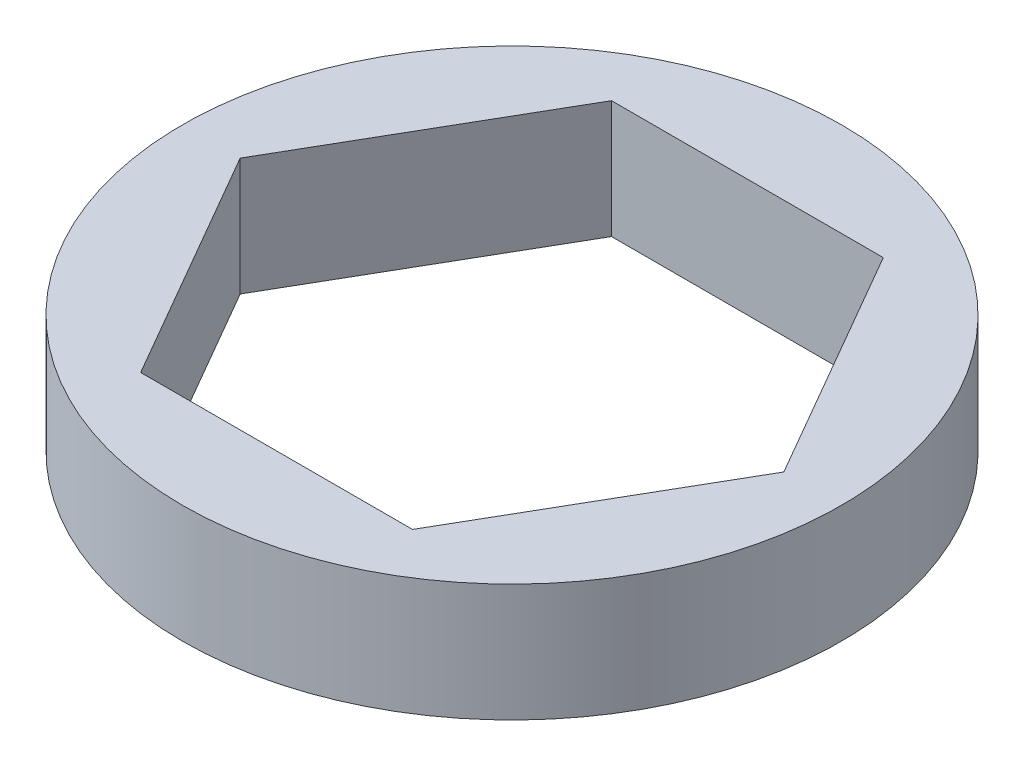
ISO-10303-21;
HEADER;
FILE_DESCRIPTION(('STEP AP214'),'2;1');
FILE_NAME('part.step','',(''),(''),'','','');
FILE_SCHEMA(('AUTOMOTIVE_DESIGN { 1 0 10303 214 1 1 1 1 }'));
ENDSEC;
DATA;
#1=APPLICATION_CONTEXT('core data for automotive mechanical design processes');
#2=APPLICATION_PROTOCOL_DEFINITION('international standard','automotive_design',2000,#1);
#3=PRODUCT_CONTEXT('',#1,'mechanical');
#4=PRODUCT('Part','Part','',(#3));
#5=PRODUCT_RELATED_PRODUCT_CATEGORY('part','',(#4));
#6=PRODUCT_DEFINITION_FORMATION('','',#4);
#7=PRODUCT_DEFINITION_CONTEXT('part definition',#1,'design');
#8=PRODUCT_DEFINITION('design','',#6,#7);
#9=PRODUCT_DEFINITION_SHAPE('','',#8);
#10=(LENGTH_UNIT() NAMED_UNIT(*) SI_UNIT(.MILLI.,.METRE.));
#11=(NAMED_UNIT(*) PLANE_ANGLE_UNIT() SI_UNIT($,.RADIAN.));
#12=(NAMED_UNIT(*) SI_UNIT($,.STERADIAN.) SOLID_ANGLE_UNIT());
#13=UNCERTAINTY_MEASURE_WITH_UNIT(LENGTH_MEASURE(1.E-05),#10,'distance_accuracy_value','');
#14=(GEOMETRIC_REPRESENTATION_CONTEXT(3) GLOBAL_UNCERTAINTY_ASSIGNED_CONTEXT((#13)) GLOBAL_UNIT_ASSIGNED_CONTEXT((#10,
#11,#12)) REPRESENTATION_CONTEXT('',''));
#15=CARTESIAN_POINT('',(0.,0.,0.));
#16=DIRECTION('',(0.,0.,1.));
#17=DIRECTION('',(1.,0.,0.));
#18=AXIS2_PLACEMENT_3D('',#15,#16,#17);
#19=CARTESIAN_POINT('',(0.,3.175,0.));
#20=DIRECTION('',(0.,1.,0.));
#21=DIRECTION('',(0.,0.,1.));
#22=AXIS2_PLACEMENT_3D('',#19,#20,#21);
#23=PLANE('',#22);
#24=CARTESIAN_POINT('',(0.,3.175,0.));
#25=DIRECTION('',(0.,1.,0.));
#26=DIRECTION('',(0.,0.,1.));
#27=AXIS2_PLACEMENT_3D('',#24,#25,#26);
#28=CIRCLE('',#27,8.89);
#29=CARTESIAN_POINT('',(0.,3.175,8.89));
#30=VERTEX_POINT('',#29);
#31=EDGE_CURVE('E11',#30,#30,#28,.T.);
#32=ORIENTED_EDGE('',*,*,#31,.T.);
#33=EDGE_LOOP('',(#32));
#34=FACE_BOUND('',#33,.T.);
#35=DIRECTION('',(-0.5,0.,-0.866025403784439));
#36=VECTOR('',#35,1.);
#37=CARTESIAN_POINT('',(7.33234841870825,3.175,0.));
#38=LINE('',#37,#36);
#39=CARTESIAN_POINT('',(7.33234841870825,3.175,0.));
#40=VERTEX_POINT('',#39);
#41=CARTESIAN_POINT('',(3.66617420935412,3.175,-6.35000000000001));
#42=VERTEX_POINT('',#41);
#43=EDGE_CURVE('E108',#40,#42,#38,.T.);
#44=ORIENTED_EDGE('',*,*,#43,.F.);
#45=DIRECTION('',(0.5,0.,-0.866025403784439));
#46=VECTOR('',#45,1.);
#47=CARTESIAN_POINT('',(3.66617420935413,3.175,6.35));
#48=LINE('',#47,#46);
#49=CARTESIAN_POINT('',(3.66617420935413,3.175,6.35));
#50=VERTEX_POINT('',#49);
#51=EDGE_CURVE('E99',#50,#40,#48,.T.);
#52=ORIENTED_EDGE('',*,*,#51,.F.);
#53=DIRECTION('',(1.,0.,0.));
#54=VECTOR('',#53,1.);
#55=CARTESIAN_POINT('',(-3.66617420935413,3.175,6.35));
#56=LINE('',#55,#54);
#57=CARTESIAN_POINT('',(-3.66617420935413,3.175,6.35));
#58=VERTEX_POINT('',#57);
#59=EDGE_CURVE('E133',#58,#50,#56,.T.);
#60=ORIENTED_EDGE('',*,*,#59,.F.);
#61=DIRECTION('',(0.5,0.,0.866025403784439));
#62=VECTOR('',#61,1.);
#63=CARTESIAN_POINT('',(-7.33234841870825,3.175,0.));
#64=LINE('',#63,#62);
#65=CARTESIAN_POINT('',(-7.33234841870825,3.175,0.));
#66=VERTEX_POINT('',#65);
#67=EDGE_CURVE('E130',#66,#58,#64,.T.);
#68=ORIENTED_EDGE('',*,*,#67,.F.);
#69=DIRECTION('',(-0.5,0.,0.866025403784439));
#70=VECTOR('',#69,1.);
#71=CARTESIAN_POINT('',(-3.66617420935413,3.175,-6.35000000000001));
#72=LINE('',#71,#70);
#73=CARTESIAN_POINT('',(-3.66617420935413,3.175,-6.35000000000001));
#74=VERTEX_POINT('',#73);
#75=EDGE_CURVE('E125',#74,#66,#72,.T.);
#76=ORIENTED_EDGE('',*,*,#75,.F.);
#77=DIRECTION('',(-1.,0.,0.));
#78=VECTOR('',#77,1.);
#79=CARTESIAN_POINT('',(3.66617420935412,3.175,-6.35000000000001));
#80=LINE('',#79,#78);
#81=EDGE_CURVE('E121',#42,#74,#80,.T.);
#82=ORIENTED_EDGE('',*,*,#81,.F.);
#83=EDGE_LOOP('',(#44,#52,#60,#68,#76,#82));
#84=FACE_BOUND('',#83,.T.);
#85=ADVANCED_FACE('F45',(#34,#84),#23,.T.);
#86=CARTESIAN_POINT('',(0.,0.,0.));
#87=DIRECTION('',(0.,1.,0.));
#88=DIRECTION('',(0.,0.,1.));
#89=AXIS2_PLACEMENT_3D('',#86,#87,#88);
#90=PLANE('',#89);
#91=CARTESIAN_POINT('',(0.,0.,0.));
#92=DIRECTION('',(0.,1.,0.));
#93=DIRECTION('',(0.,0.,1.));
#94=AXIS2_PLACEMENT_3D('',#91,#92,#93);
#95=CIRCLE('',#94,8.89);
#96=CARTESIAN_POINT('',(0.,0.,8.89));
#97=VERTEX_POINT('',#96);
#98=EDGE_CURVE('E49',#97,#97,#95,.T.);
#99=ORIENTED_EDGE('',*,*,#98,.F.);
#100=EDGE_LOOP('',(#99));
#101=FACE_BOUND('',#100,.T.);
#102=DIRECTION('',(0.5,0.,-0.866025403784439));
#103=VECTOR('',#102,1.);
#104=CARTESIAN_POINT('',(3.66617420935413,0.,6.35));
#105=LINE('',#104,#103);
#106=CARTESIAN_POINT('',(3.66617420935413,0.,6.35));
#107=VERTEX_POINT('',#106);
#108=CARTESIAN_POINT('',(7.33234841870825,0.,0.));
#109=VERTEX_POINT('',#108);
#110=EDGE_CURVE('E69',#107,#109,#105,.T.);
#111=ORIENTED_EDGE('',*,*,#110,.T.);
#112=DIRECTION('',(-0.5,0.,-0.866025403784439));
#113=VECTOR('',#112,1.);
#114=CARTESIAN_POINT('',(7.33234841870825,0.,0.));
#115=LINE('',#114,#113);
#116=CARTESIAN_POINT('',(3.66617420935412,0.,-6.35000000000001));
#117=VERTEX_POINT('',#116);
#118=EDGE_CURVE('E115',#109,#117,#115,.T.);
#119=ORIENTED_EDGE('',*,*,#118,.T.);
#120=DIRECTION('',(-1.,0.,0.));
#121=VECTOR('',#120,1.);
#122=CARTESIAN_POINT('',(3.66617420935412,0.,-6.35000000000001));
#123=LINE('',#122,#121);
#124=CARTESIAN_POINT('',(-3.66617420935413,0.,-6.35000000000001));
#125=VERTEX_POINT('',#124);
#126=EDGE_CURVE('E140',#117,#125,#123,.T.);
#127=ORIENTED_EDGE('',*,*,#126,.T.);
#128=DIRECTION('',(-0.5,0.,0.866025403784439));
#129=VECTOR('',#128,1.);
#130=CARTESIAN_POINT('',(-3.66617420935413,0.,-6.35000000000001));
#131=LINE('',#130,#129);
#132=CARTESIAN_POINT('',(-7.33234841870825,0.,0.));
#133=VERTEX_POINT('',#132);
#134=EDGE_CURVE('E144',#125,#133,#131,.T.);
#135=ORIENTED_EDGE('',*,*,#134,.T.);
#136=DIRECTION('',(0.5,0.,0.866025403784439));
#137=VECTOR('',#136,1.);
#138=CARTESIAN_POINT('',(-7.33234841870825,0.,0.));
#139=LINE('',#138,#137);
#140=CARTESIAN_POINT('',(-3.66617420935413,0.,6.35));
#141=VERTEX_POINT('',#140);
#142=EDGE_CURVE('E148',#133,#141,#139,.T.);
#143=ORIENTED_EDGE('',*,*,#142,.T.);
#144=DIRECTION('',(1.,0.,0.));
#145=VECTOR('',#144,1.);
#146=CARTESIAN_POINT('',(-3.66617420935413,0.,6.35));
#147=LINE('',#146,#145);
#148=EDGE_CURVE('E109',#141,#107,#147,.T.);
#149=ORIENTED_EDGE('',*,*,#148,.T.);
#150=EDGE_LOOP('',(#111,#119,#127,#135,#143,#149));
#151=FACE_BOUND('',#150,.T.);
#152=ADVANCED_FACE('F172',(#101,#151),#90,.F.);
#153=CARTESIAN_POINT('',(0.,3.175,0.));
#154=DIRECTION('',(0.,-1.,0.));
#155=DIRECTION('',(0.,0.,-1.));
#156=AXIS2_PLACEMENT_3D('',#153,#154,#155);
#157=CYLINDRICAL_SURFACE('',#156,8.89);
#158=ORIENTED_EDGE('',*,*,#31,.F.);
#159=EDGE_LOOP('',(#158));
#160=FACE_BOUND('',#159,.T.);
#161=ORIENTED_EDGE('',*,*,#98,.T.);
#162=EDGE_LOOP('',(#161));
#163=FACE_BOUND('',#162,.T.);
#164=ADVANCED_FACE('F47',(#160,#163),#157,.T.);
#165=CARTESIAN_POINT('',(3.66617420935413,3.175,6.35));
#166=DIRECTION('',(-0.866025403784439,0.,-0.5));
#167=DIRECTION('',(-0.5,0.,0.866025403784439));
#168=AXIS2_PLACEMENT_3D('',#165,#166,#167);
#169=PLANE('',#168);
#170=ORIENTED_EDGE('',*,*,#110,.F.);
#171=DIRECTION('',(0.,-1.,0.));
#172=VECTOR('',#171,1.);
#173=CARTESIAN_POINT('',(3.66617420935413,3.175,6.35));
#174=LINE('',#173,#172);
#175=EDGE_CURVE('E103',#50,#107,#174,.T.);
#176=ORIENTED_EDGE('',*,*,#175,.F.);
#177=ORIENTED_EDGE('',*,*,#51,.T.);
#178=DIRECTION('',(0.,-1.,0.));
#179=VECTOR('',#178,1.);
#180=CARTESIAN_POINT('',(7.33234841870825,3.175,0.));
#181=LINE('',#180,#179);
#182=EDGE_CURVE('E102',#40,#109,#181,.T.);
#183=ORIENTED_EDGE('',*,*,#182,.T.);
#184=EDGE_LOOP('',(#170,#176,#177,#183));
#185=FACE_BOUND('',#184,.T.);
#186=ADVANCED_FACE('F101',(#185),#169,.T.);
#187=CARTESIAN_POINT('',(7.33234841870825,3.175,0.));
#188=DIRECTION('',(-0.866025403784439,0.,0.5));
#189=DIRECTION('',(0.5,0.,0.866025403784439));
#190=AXIS2_PLACEMENT_3D('',#187,#188,#189);
#191=PLANE('',#190);
#192=ORIENTED_EDGE('',*,*,#118,.F.);
#193=ORIENTED_EDGE('',*,*,#182,.F.);
#194=ORIENTED_EDGE('',*,*,#43,.T.);
#195=DIRECTION('',(0.,-1.,0.));
#196=VECTOR('',#195,1.);
#197=CARTESIAN_POINT('',(3.66617420935412,3.175,-6.35000000000001));
#198=LINE('',#197,#196);
#199=EDGE_CURVE('E117',#42,#117,#198,.T.);
#200=ORIENTED_EDGE('',*,*,#199,.T.);
#201=EDGE_LOOP('',(#192,#193,#194,#200));
#202=FACE_BOUND('',#201,.T.);
#203=ADVANCED_FACE('F112',(#202),#191,.T.);
#204=CARTESIAN_POINT('',(3.66617420935412,3.175,-6.35000000000001));
#205=DIRECTION('',(0.,0.,1.));
#206=DIRECTION('',(1.,0.,0.));
#207=AXIS2_PLACEMENT_3D('',#204,#205,#206);
#208=PLANE('',#207);
#209=ORIENTED_EDGE('',*,*,#126,.F.);
#210=ORIENTED_EDGE('',*,*,#199,.F.);
#211=ORIENTED_EDGE('',*,*,#81,.T.);
#212=DIRECTION('',(0.,-1.,0.));
#213=VECTOR('',#212,1.);
#214=CARTESIAN_POINT('',(-3.66617420935413,3.175,-6.35000000000001));
#215=LINE('',#214,#213);
#216=EDGE_CURVE('E162',#74,#125,#215,.T.);
#217=ORIENTED_EDGE('',*,*,#216,.T.);
#218=EDGE_LOOP('',(#209,#210,#211,#217));
#219=FACE_BOUND('',#218,.T.);
#220=ADVANCED_FACE('F168',(#219),#208,.T.);
#221=CARTESIAN_POINT('',(-3.66617420935413,3.175,-6.35000000000001));
#222=DIRECTION('',(0.866025403784439,0.,0.5));
#223=DIRECTION('',(0.5,0.,-0.866025403784439));
#224=AXIS2_PLACEMENT_3D('',#221,#222,#223);
#225=PLANE('',#224);
#226=ORIENTED_EDGE('',*,*,#134,.F.);
#227=ORIENTED_EDGE('',*,*,#216,.F.);
#228=ORIENTED_EDGE('',*,*,#75,.T.);
#229=DIRECTION('',(0.,-1.,0.));
#230=VECTOR('',#229,1.);
#231=CARTESIAN_POINT('',(-7.33234841870825,3.175,0.));
#232=LINE('',#231,#230);
#233=EDGE_CURVE('E159',#66,#133,#232,.T.);
#234=ORIENTED_EDGE('',*,*,#233,.T.);
#235=EDGE_LOOP('',(#226,#227,#228,#234));
#236=FACE_BOUND('',#235,.T.);
#237=ADVANCED_FACE('F180',(#236),#225,.T.);
#238=CARTESIAN_POINT('',(-7.33234841870825,3.175,0.));
#239=DIRECTION('',(0.866025403784439,0.,-0.5));
#240=DIRECTION('',(-0.5,0.,-0.866025403784439));
#241=AXIS2_PLACEMENT_3D('',#238,#239,#240);
#242=PLANE('',#241);
#243=ORIENTED_EDGE('',*,*,#142,.F.);
#244=ORIENTED_EDGE('',*,*,#233,.F.);
#245=ORIENTED_EDGE('',*,*,#67,.T.);
#246=DIRECTION('',(0.,-1.,0.));
#247=VECTOR('',#246,1.);
#248=CARTESIAN_POINT('',(-3.66617420935413,3.175,6.35));
#249=LINE('',#248,#247);
#250=EDGE_CURVE('E61',#58,#141,#249,.T.);
#251=ORIENTED_EDGE('',*,*,#250,.T.);
#252=EDGE_LOOP('',(#243,#244,#245,#251));
#253=FACE_BOUND('',#252,.T.);
#254=ADVANCED_FACE('F178',(#253),#242,.T.);
#255=CARTESIAN_POINT('',(-3.66617420935413,3.175,6.35));
#256=DIRECTION('',(0.,0.,-1.));
#257=DIRECTION('',(-1.,0.,0.));
#258=AXIS2_PLACEMENT_3D('',#255,#256,#257);
#259=PLANE('',#258);
#260=ORIENTED_EDGE('',*,*,#148,.F.);
#261=ORIENTED_EDGE('',*,*,#250,.F.);
#262=ORIENTED_EDGE('',*,*,#59,.T.);
#263=ORIENTED_EDGE('',*,*,#175,.T.);
#264=EDGE_LOOP('',(#260,#261,#262,#263));
#265=FACE_BOUND('',#264,.T.);
#266=ADVANCED_FACE('F174',(#265),#259,.T.);
#267=CLOSED_SHELL('',(#85,#152,#164,#186,#203,#220,#237,#254,#266));
#268=MANIFOLD_SOLID_BREP('B2',#267);
#269=ADVANCED_BREP_SHAPE_REPRESENTATION('',(#18,#268),#14);
#270=SHAPE_DEFINITION_REPRESENTATION(#9,#269);
ENDSEC;
END-ISO-10303-21;
